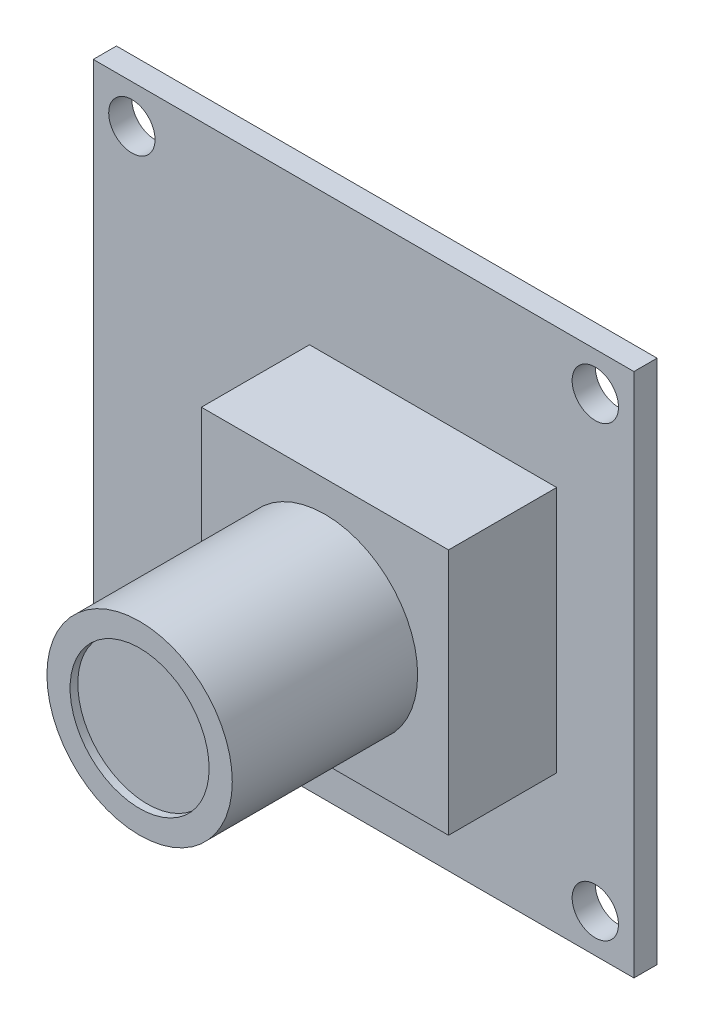
ISO-10303-21;
HEADER;
FILE_DESCRIPTION(('STEP AP214'),'2;1');
FILE_NAME('part.step','',(''),(''),'','','');
FILE_SCHEMA(('AUTOMOTIVE_DESIGN { 1 0 10303 214 1 1 1 1 }'));
ENDSEC;
DATA;
#1=APPLICATION_CONTEXT('core data for automotive mechanical design processes');
#2=APPLICATION_PROTOCOL_DEFINITION('international standard','automotive_design',2000,#1);
#3=PRODUCT_CONTEXT('',#1,'mechanical');
#4=PRODUCT('Part','Part','',(#3));
#5=PRODUCT_RELATED_PRODUCT_CATEGORY('part','',(#4));
#6=PRODUCT_DEFINITION_FORMATION('','',#4);
#7=PRODUCT_DEFINITION_CONTEXT('part definition',#1,'design');
#8=PRODUCT_DEFINITION('design','',#6,#7);
#9=PRODUCT_DEFINITION_SHAPE('','',#8);
#10=(LENGTH_UNIT() NAMED_UNIT(*) SI_UNIT(.MILLI.,.METRE.));
#11=(NAMED_UNIT(*) PLANE_ANGLE_UNIT() SI_UNIT($,.RADIAN.));
#12=(NAMED_UNIT(*) SI_UNIT($,.STERADIAN.) SOLID_ANGLE_UNIT());
#13=UNCERTAINTY_MEASURE_WITH_UNIT(LENGTH_MEASURE(1.E-05),#10,'distance_accuracy_value','');
#14=(GEOMETRIC_REPRESENTATION_CONTEXT(3) GLOBAL_UNCERTAINTY_ASSIGNED_CONTEXT((#13)) GLOBAL_UNIT_ASSIGNED_CONTEXT((#10,
#11,#12)) REPRESENTATION_CONTEXT('',''));
#15=CARTESIAN_POINT('',(0.,0.,0.));
#16=DIRECTION('',(0.,0.,1.));
#17=DIRECTION('',(1.,0.,0.));
#18=AXIS2_PLACEMENT_3D('',#15,#16,#17);
#19=CARTESIAN_POINT('',(0.,0.,-1.5));
#20=DIRECTION('',(0.,0.,-1.));
#21=DIRECTION('',(-1.,0.,0.));
#22=AXIS2_PLACEMENT_3D('',#19,#20,#21);
#23=PLANE('',#22);
#24=CARTESIAN_POINT('',(-15.,14.5,-1.5));
#25=DIRECTION('',(0.,0.,-1.));
#26=DIRECTION('',(-1.,0.,0.));
#27=AXIS2_PLACEMENT_3D('',#24,#25,#26);
#28=CIRCLE('',#27,1.5);
#29=CARTESIAN_POINT('',(-16.5,14.5,-1.5));
#30=VERTEX_POINT('',#29);
#31=EDGE_CURVE('E196',#30,#30,#28,.F.);
#32=ORIENTED_EDGE('',*,*,#31,.T.);
#33=EDGE_LOOP('',(#32));
#34=FACE_BOUND('',#33,.T.);
#35=CARTESIAN_POINT('',(15.,14.5,-1.5));
#36=DIRECTION('',(0.,0.,-1.));
#37=DIRECTION('',(-1.,0.,0.));
#38=AXIS2_PLACEMENT_3D('',#35,#36,#37);
#39=CIRCLE('',#38,1.5);
#40=CARTESIAN_POINT('',(13.5,14.5,-1.5));
#41=VERTEX_POINT('',#40);
#42=EDGE_CURVE('E207',#41,#41,#39,.F.);
#43=ORIENTED_EDGE('',*,*,#42,.T.);
#44=EDGE_LOOP('',(#43));
#45=FACE_BOUND('',#44,.T.);
#46=CARTESIAN_POINT('',(15.,-14.5,-1.5));
#47=DIRECTION('',(0.,0.,-1.));
#48=DIRECTION('',(-1.,0.,0.));
#49=AXIS2_PLACEMENT_3D('',#46,#47,#48);
#50=CIRCLE('',#49,1.5);
#51=CARTESIAN_POINT('',(13.5,-14.5,-1.5));
#52=VERTEX_POINT('',#51);
#53=EDGE_CURVE('E201',#52,#52,#50,.F.);
#54=ORIENTED_EDGE('',*,*,#53,.T.);
#55=EDGE_LOOP('',(#54));
#56=FACE_BOUND('',#55,.T.);
#57=CARTESIAN_POINT('',(-15.,-14.5,-1.5));
#58=DIRECTION('',(0.,0.,-1.));
#59=DIRECTION('',(-1.,0.,0.));
#60=AXIS2_PLACEMENT_3D('',#57,#58,#59);
#61=CIRCLE('',#60,1.5);
#62=CARTESIAN_POINT('',(-16.5,-14.5,-1.5));
#63=VERTEX_POINT('',#62);
#64=EDGE_CURVE('E200',#63,#63,#61,.F.);
#65=ORIENTED_EDGE('',*,*,#64,.T.);
#66=EDGE_LOOP('',(#65));
#67=FACE_BOUND('',#66,.T.);
#68=DIRECTION('',(1.,0.,0.));
#69=VECTOR('',#68,1.);
#70=CARTESIAN_POINT('',(-17.5,17.,-1.5));
#71=LINE('',#70,#69);
#72=CARTESIAN_POINT('',(-17.5,17.,-1.5));
#73=VERTEX_POINT('',#72);
#74=CARTESIAN_POINT('',(17.5,17.,-1.5));
#75=VERTEX_POINT('',#74);
#76=EDGE_CURVE('E221',#73,#75,#71,.T.);
#77=ORIENTED_EDGE('',*,*,#76,.T.);
#78=DIRECTION('',(0.,-1.,0.));
#79=VECTOR('',#78,1.);
#80=CARTESIAN_POINT('',(17.5,17.,-1.5));
#81=LINE('',#80,#79);
#82=CARTESIAN_POINT('',(17.5,-17.,-1.5));
#83=VERTEX_POINT('',#82);
#84=EDGE_CURVE('E224',#75,#83,#81,.T.);
#85=ORIENTED_EDGE('',*,*,#84,.T.);
#86=DIRECTION('',(1.,0.,0.));
#87=VECTOR('',#86,1.);
#88=CARTESIAN_POINT('',(-17.5,-17.,-1.5));
#89=LINE('',#88,#87);
#90=CARTESIAN_POINT('',(-17.5,-17.,-1.5));
#91=VERTEX_POINT('',#90);
#92=EDGE_CURVE('E227',#91,#83,#89,.T.);
#93=ORIENTED_EDGE('',*,*,#92,.F.);
#94=DIRECTION('',(0.,-1.,0.));
#95=VECTOR('',#94,1.);
#96=CARTESIAN_POINT('',(-17.5,17.,-1.5));
#97=LINE('',#96,#95);
#98=EDGE_CURVE('E230',#73,#91,#97,.T.);
#99=ORIENTED_EDGE('',*,*,#98,.F.);
#100=EDGE_LOOP('',(#77,#85,#93,#99));
#101=FACE_BOUND('',#100,.T.);
#102=DIRECTION('',(1.,0.,0.));
#103=VECTOR('',#102,1.);
#104=CARTESIAN_POINT('',(-8.,10.,-1.5));
#105=LINE('',#104,#103);
#106=CARTESIAN_POINT('',(-12.,10.,-1.5));
#107=VERTEX_POINT('',#106);
#108=CARTESIAN_POINT('',(-8.,10.,-1.5));
#109=VERTEX_POINT('',#108);
#110=EDGE_CURVE('E496',#107,#109,#105,.T.);
#111=ORIENTED_EDGE('',*,*,#110,.F.);
#112=DIRECTION('',(0.,1.,0.));
#113=VECTOR('',#112,1.);
#114=CARTESIAN_POINT('',(-12.,10.,-1.5));
#115=LINE('',#114,#113);
#116=CARTESIAN_POINT('',(-12.,-10.,-1.5));
#117=VERTEX_POINT('',#116);
#118=EDGE_CURVE('E151',#117,#107,#115,.T.);
#119=ORIENTED_EDGE('',*,*,#118,.F.);
#120=DIRECTION('',(-1.,0.,0.));
#121=VECTOR('',#120,1.);
#122=CARTESIAN_POINT('',(-8.,-10.,-1.5));
#123=LINE('',#122,#121);
#124=CARTESIAN_POINT('',(-8.,-10.,-1.5));
#125=VERTEX_POINT('',#124);
#126=EDGE_CURVE('E147',#125,#117,#123,.T.);
#127=ORIENTED_EDGE('',*,*,#126,.F.);
#128=DIRECTION('',(0.,-1.,0.));
#129=VECTOR('',#128,1.);
#130=CARTESIAN_POINT('',(-8.,10.,-1.5));
#131=LINE('',#130,#129);
#132=EDGE_CURVE('E493',#109,#125,#131,.T.);
#133=ORIENTED_EDGE('',*,*,#132,.F.);
#134=EDGE_LOOP('',(#111,#119,#127,#133));
#135=FACE_BOUND('',#134,.T.);
#136=ADVANCED_FACE('F38',(#34,#45,#56,#67,#101,#135),#23,.T.);
#137=CARTESIAN_POINT('',(0.,0.,0.));
#138=DIRECTION('',(0.,0.,-1.));
#139=DIRECTION('',(-1.,0.,0.));
#140=AXIS2_PLACEMENT_3D('',#137,#138,#139);
#141=PLANE('',#140);
#142=DIRECTION('',(1.,0.,0.));
#143=VECTOR('',#142,1.);
#144=CARTESIAN_POINT('',(-17.5,17.,0.));
#145=LINE('',#144,#143);
#146=CARTESIAN_POINT('',(-17.5,17.,0.));
#147=VERTEX_POINT('',#146);
#148=CARTESIAN_POINT('',(17.5,17.,0.));
#149=VERTEX_POINT('',#148);
#150=EDGE_CURVE('E218',#147,#149,#145,.T.);
#151=ORIENTED_EDGE('',*,*,#150,.F.);
#152=DIRECTION('',(0.,-1.,0.));
#153=VECTOR('',#152,1.);
#154=CARTESIAN_POINT('',(-17.5,17.,0.));
#155=LINE('',#154,#153);
#156=CARTESIAN_POINT('',(-17.5,-17.,0.));
#157=VERTEX_POINT('',#156);
#158=EDGE_CURVE('E225',#147,#157,#155,.T.);
#159=ORIENTED_EDGE('',*,*,#158,.T.);
#160=DIRECTION('',(1.,0.,0.));
#161=VECTOR('',#160,1.);
#162=CARTESIAN_POINT('',(-17.5,-17.,0.));
#163=LINE('',#162,#161);
#164=CARTESIAN_POINT('',(17.5,-17.,0.));
#165=VERTEX_POINT('',#164);
#166=EDGE_CURVE('E239',#157,#165,#163,.T.);
#167=ORIENTED_EDGE('',*,*,#166,.T.);
#168=DIRECTION('',(0.,-1.,0.));
#169=VECTOR('',#168,1.);
#170=CARTESIAN_POINT('',(17.5,17.,0.));
#171=LINE('',#170,#169);
#172=EDGE_CURVE('E236',#149,#165,#171,.T.);
#173=ORIENTED_EDGE('',*,*,#172,.F.);
#174=EDGE_LOOP('',(#151,#159,#167,#173));
#175=FACE_BOUND('',#174,.T.);
#176=CARTESIAN_POINT('',(-15.,-14.5,0.));
#177=DIRECTION('',(0.,0.,1.));
#178=DIRECTION('',(1.,0.,0.));
#179=AXIS2_PLACEMENT_3D('',#176,#177,#178);
#180=CIRCLE('',#179,1.5);
#181=CARTESIAN_POINT('',(-13.5,-14.5,0.));
#182=VERTEX_POINT('',#181);
#183=EDGE_CURVE('E215',#182,#182,#180,.T.);
#184=ORIENTED_EDGE('',*,*,#183,.F.);
#185=EDGE_LOOP('',(#184));
#186=FACE_BOUND('',#185,.T.);
#187=CARTESIAN_POINT('',(15.,-14.5,0.));
#188=DIRECTION('',(0.,0.,1.));
#189=DIRECTION('',(-1.,0.,0.));
#190=AXIS2_PLACEMENT_3D('',#187,#188,#189);
#191=CIRCLE('',#190,1.5);
#192=CARTESIAN_POINT('',(13.5,-14.5,0.));
#193=VERTEX_POINT('',#192);
#194=EDGE_CURVE('E197',#193,#193,#191,.T.);
#195=ORIENTED_EDGE('',*,*,#194,.F.);
#196=EDGE_LOOP('',(#195));
#197=FACE_BOUND('',#196,.T.);
#198=CARTESIAN_POINT('',(15.,14.5,0.));
#199=DIRECTION('',(0.,0.,1.));
#200=DIRECTION('',(1.,0.,0.));
#201=AXIS2_PLACEMENT_3D('',#198,#199,#200);
#202=CIRCLE('',#201,1.5);
#203=CARTESIAN_POINT('',(16.5,14.5,0.));
#204=VERTEX_POINT('',#203);
#205=EDGE_CURVE('E204',#204,#204,#202,.T.);
#206=ORIENTED_EDGE('',*,*,#205,.F.);
#207=EDGE_LOOP('',(#206));
#208=FACE_BOUND('',#207,.T.);
#209=CARTESIAN_POINT('',(-15.,14.5,0.));
#210=DIRECTION('',(0.,0.,1.));
#211=DIRECTION('',(-1.,0.,0.));
#212=AXIS2_PLACEMENT_3D('',#209,#210,#211);
#213=CIRCLE('',#212,1.5);
#214=CARTESIAN_POINT('',(-16.5,14.5,0.));
#215=VERTEX_POINT('',#214);
#216=EDGE_CURVE('E210',#215,#215,#213,.T.);
#217=ORIENTED_EDGE('',*,*,#216,.F.);
#218=EDGE_LOOP('',(#217));
#219=FACE_BOUND('',#218,.T.);
#220=DIRECTION('',(0.,-1.,0.));
#221=VECTOR('',#220,1.);
#222=CARTESIAN_POINT('',(-3.5,-8.,0.));
#223=LINE('',#222,#221);
#224=CARTESIAN_POINT('',(-3.5,8.,0.));
#225=VERTEX_POINT('',#224);
#226=CARTESIAN_POINT('',(-3.5,-8.,0.));
#227=VERTEX_POINT('',#226);
#228=EDGE_CURVE('E165',#225,#227,#223,.T.);
#229=ORIENTED_EDGE('',*,*,#228,.F.);
#230=DIRECTION('',(-1.,0.,0.));
#231=VECTOR('',#230,1.);
#232=CARTESIAN_POINT('',(-3.5,8.,0.));
#233=LINE('',#232,#231);
#234=CARTESIAN_POINT('',(12.5,8.,0.));
#235=VERTEX_POINT('',#234);
#236=EDGE_CURVE('E171',#235,#225,#233,.T.);
#237=ORIENTED_EDGE('',*,*,#236,.F.);
#238=DIRECTION('',(0.,1.,0.));
#239=VECTOR('',#238,1.);
#240=CARTESIAN_POINT('',(12.5,8.,0.));
#241=LINE('',#240,#239);
#242=CARTESIAN_POINT('',(12.5,-8.,0.));
#243=VERTEX_POINT('',#242);
#244=EDGE_CURVE('E181',#243,#235,#241,.T.);
#245=ORIENTED_EDGE('',*,*,#244,.F.);
#246=DIRECTION('',(1.,0.,0.));
#247=VECTOR('',#246,1.);
#248=CARTESIAN_POINT('',(12.5,-8.,0.));
#249=LINE('',#248,#247);
#250=EDGE_CURVE('E62',#227,#243,#249,.T.);
#251=ORIENTED_EDGE('',*,*,#250,.F.);
#252=EDGE_LOOP('',(#229,#237,#245,#251));
#253=FACE_BOUND('',#252,.T.);
#254=ADVANCED_FACE('F259',(#175,#186,#197,#208,#219,#253),#141,.F.);
#255=CARTESIAN_POINT('',(-17.5,17.,-1.5));
#256=DIRECTION('',(0.,-1.,0.));
#257=DIRECTION('',(0.,0.,-1.));
#258=AXIS2_PLACEMENT_3D('',#255,#256,#257);
#259=PLANE('',#258);
#260=ORIENTED_EDGE('',*,*,#150,.T.);
#261=DIRECTION('',(0.,0.,1.));
#262=VECTOR('',#261,1.);
#263=CARTESIAN_POINT('',(17.5,17.,-1.5));
#264=LINE('',#263,#262);
#265=EDGE_CURVE('E42',#75,#149,#264,.T.);
#266=ORIENTED_EDGE('',*,*,#265,.F.);
#267=ORIENTED_EDGE('',*,*,#76,.F.);
#268=DIRECTION('',(0.,0.,1.));
#269=VECTOR('',#268,1.);
#270=CARTESIAN_POINT('',(-17.5,17.,-1.5));
#271=LINE('',#270,#269);
#272=EDGE_CURVE('E233',#73,#147,#271,.T.);
#273=ORIENTED_EDGE('',*,*,#272,.T.);
#274=EDGE_LOOP('',(#260,#266,#267,#273));
#275=FACE_BOUND('',#274,.T.);
#276=ADVANCED_FACE('F40',(#275),#259,.F.);
#277=CARTESIAN_POINT('',(17.5,17.,-1.5));
#278=DIRECTION('',(-1.,0.,0.));
#279=DIRECTION('',(0.,-1.,0.));
#280=AXIS2_PLACEMENT_3D('',#277,#278,#279);
#281=PLANE('',#280);
#282=ORIENTED_EDGE('',*,*,#172,.T.);
#283=DIRECTION('',(0.,0.,1.));
#284=VECTOR('',#283,1.);
#285=CARTESIAN_POINT('',(17.5,-17.,-1.5));
#286=LINE('',#285,#284);
#287=EDGE_CURVE('E246',#83,#165,#286,.T.);
#288=ORIENTED_EDGE('',*,*,#287,.F.);
#289=ORIENTED_EDGE('',*,*,#84,.F.);
#290=ORIENTED_EDGE('',*,*,#265,.T.);
#291=EDGE_LOOP('',(#282,#288,#289,#290));
#292=FACE_BOUND('',#291,.T.);
#293=ADVANCED_FACE('F253',(#292),#281,.F.);
#294=CARTESIAN_POINT('',(-17.5,-17.,-1.5));
#295=DIRECTION('',(0.,-1.,0.));
#296=DIRECTION('',(0.,0.,-1.));
#297=AXIS2_PLACEMENT_3D('',#294,#295,#296);
#298=PLANE('',#297);
#299=ORIENTED_EDGE('',*,*,#166,.F.);
#300=DIRECTION('',(0.,0.,1.));
#301=VECTOR('',#300,1.);
#302=CARTESIAN_POINT('',(-17.5,-17.,-1.5));
#303=LINE('',#302,#301);
#304=EDGE_CURVE('E245',#91,#157,#303,.T.);
#305=ORIENTED_EDGE('',*,*,#304,.F.);
#306=ORIENTED_EDGE('',*,*,#92,.T.);
#307=ORIENTED_EDGE('',*,*,#287,.T.);
#308=EDGE_LOOP('',(#299,#305,#306,#307));
#309=FACE_BOUND('',#308,.T.);
#310=ADVANCED_FACE('F265',(#309),#298,.T.);
#311=CARTESIAN_POINT('',(-17.5,17.,-1.5));
#312=DIRECTION('',(-1.,0.,0.));
#313=DIRECTION('',(0.,-1.,0.));
#314=AXIS2_PLACEMENT_3D('',#311,#312,#313);
#315=PLANE('',#314);
#316=ORIENTED_EDGE('',*,*,#158,.F.);
#317=ORIENTED_EDGE('',*,*,#272,.F.);
#318=ORIENTED_EDGE('',*,*,#98,.T.);
#319=ORIENTED_EDGE('',*,*,#304,.T.);
#320=EDGE_LOOP('',(#316,#317,#318,#319));
#321=FACE_BOUND('',#320,.T.);
#322=ADVANCED_FACE('F262',(#321),#315,.T.);
#323=CARTESIAN_POINT('',(-15.,-14.5,-1.501));
#324=DIRECTION('',(0.,0.,1.));
#325=DIRECTION('',(1.,0.,0.));
#326=AXIS2_PLACEMENT_3D('',#323,#324,#325);
#327=CYLINDRICAL_SURFACE('',#326,1.5);
#328=ORIENTED_EDGE('',*,*,#64,.F.);
#329=EDGE_LOOP('',(#328));
#330=FACE_BOUND('',#329,.T.);
#331=ORIENTED_EDGE('',*,*,#183,.T.);
#332=EDGE_LOOP('',(#331));
#333=FACE_BOUND('',#332,.T.);
#334=ADVANCED_FACE('F272',(#330,#333),#327,.F.);
#335=CARTESIAN_POINT('',(15.,-14.5,-1.501));
#336=DIRECTION('',(0.,0.,1.));
#337=DIRECTION('',(1.,0.,0.));
#338=AXIS2_PLACEMENT_3D('',#335,#336,#337);
#339=CYLINDRICAL_SURFACE('',#338,1.5);
#340=ORIENTED_EDGE('',*,*,#53,.F.);
#341=EDGE_LOOP('',(#340));
#342=FACE_BOUND('',#341,.T.);
#343=ORIENTED_EDGE('',*,*,#194,.T.);
#344=EDGE_LOOP('',(#343));
#345=FACE_BOUND('',#344,.T.);
#346=ADVANCED_FACE('F285',(#342,#345),#339,.F.);
#347=CARTESIAN_POINT('',(15.,14.5,-1.501));
#348=DIRECTION('',(0.,0.,1.));
#349=DIRECTION('',(1.,0.,0.));
#350=AXIS2_PLACEMENT_3D('',#347,#348,#349);
#351=CYLINDRICAL_SURFACE('',#350,1.5);
#352=ORIENTED_EDGE('',*,*,#42,.F.);
#353=EDGE_LOOP('',(#352));
#354=FACE_BOUND('',#353,.T.);
#355=ORIENTED_EDGE('',*,*,#205,.T.);
#356=EDGE_LOOP('',(#355));
#357=FACE_BOUND('',#356,.T.);
#358=ADVANCED_FACE('F291',(#354,#357),#351,.F.);
#359=CARTESIAN_POINT('',(-15.,14.5,-1.501));
#360=DIRECTION('',(0.,0.,1.));
#361=DIRECTION('',(1.,0.,0.));
#362=AXIS2_PLACEMENT_3D('',#359,#360,#361);
#363=CYLINDRICAL_SURFACE('',#362,1.5);
#364=ORIENTED_EDGE('',*,*,#31,.F.);
#365=EDGE_LOOP('',(#364));
#366=FACE_BOUND('',#365,.T.);
#367=ORIENTED_EDGE('',*,*,#216,.T.);
#368=EDGE_LOOP('',(#367));
#369=FACE_BOUND('',#368,.T.);
#370=ADVANCED_FACE('F287',(#366,#369),#363,.F.);
#371=CARTESIAN_POINT('',(-3.5,-8.,7.));
#372=DIRECTION('',(1.,0.,0.));
#373=DIRECTION('',(0.,1.,0.));
#374=AXIS2_PLACEMENT_3D('',#371,#372,#373);
#375=PLANE('',#374);
#376=ORIENTED_EDGE('',*,*,#228,.T.);
#377=DIRECTION('',(0.,0.,-1.));
#378=VECTOR('',#377,1.);
#379=CARTESIAN_POINT('',(-3.5,-8.,7.));
#380=LINE('',#379,#378);
#381=CARTESIAN_POINT('',(-3.5,-8.,7.));
#382=VERTEX_POINT('',#381);
#383=EDGE_CURVE('E194',#382,#227,#380,.T.);
#384=ORIENTED_EDGE('',*,*,#383,.F.);
#385=DIRECTION('',(0.,-1.,0.));
#386=VECTOR('',#385,1.);
#387=CARTESIAN_POINT('',(-3.5,-8.,7.));
#388=LINE('',#387,#386);
#389=CARTESIAN_POINT('',(-3.5,8.,7.));
#390=VERTEX_POINT('',#389);
#391=EDGE_CURVE('E167',#390,#382,#388,.T.);
#392=ORIENTED_EDGE('',*,*,#391,.F.);
#393=DIRECTION('',(0.,0.,-1.));
#394=VECTOR('',#393,1.);
#395=CARTESIAN_POINT('',(-3.5,8.,7.));
#396=LINE('',#395,#394);
#397=EDGE_CURVE('E177',#390,#225,#396,.T.);
#398=ORIENTED_EDGE('',*,*,#397,.T.);
#399=EDGE_LOOP('',(#376,#384,#392,#398));
#400=FACE_BOUND('',#399,.T.);
#401=ADVANCED_FACE('F290',(#400),#375,.F.);
#402=CARTESIAN_POINT('',(12.5,-8.,7.));
#403=DIRECTION('',(0.,1.,0.));
#404=DIRECTION('',(-1.,0.,0.));
#405=AXIS2_PLACEMENT_3D('',#402,#403,#404);
#406=PLANE('',#405);
#407=ORIENTED_EDGE('',*,*,#250,.T.);
#408=DIRECTION('',(0.,0.,-1.));
#409=VECTOR('',#408,1.);
#410=CARTESIAN_POINT('',(12.5,-8.,7.));
#411=LINE('',#410,#409);
#412=CARTESIAN_POINT('',(12.5,-8.,7.));
#413=VERTEX_POINT('',#412);
#414=EDGE_CURVE('E191',#413,#243,#411,.T.);
#415=ORIENTED_EDGE('',*,*,#414,.F.);
#416=DIRECTION('',(1.,0.,0.));
#417=VECTOR('',#416,1.);
#418=CARTESIAN_POINT('',(12.5,-8.,7.));
#419=LINE('',#418,#417);
#420=EDGE_CURVE('E170',#382,#413,#419,.T.);
#421=ORIENTED_EDGE('',*,*,#420,.F.);
#422=ORIENTED_EDGE('',*,*,#383,.T.);
#423=EDGE_LOOP('',(#407,#415,#421,#422));
#424=FACE_BOUND('',#423,.T.);
#425=ADVANCED_FACE('F301',(#424),#406,.F.);
#426=CARTESIAN_POINT('',(12.5,8.,7.));
#427=DIRECTION('',(-1.,0.,0.));
#428=DIRECTION('',(0.,0.,1.));
#429=AXIS2_PLACEMENT_3D('',#426,#427,#428);
#430=PLANE('',#429);
#431=ORIENTED_EDGE('',*,*,#244,.T.);
#432=DIRECTION('',(0.,0.,-1.));
#433=VECTOR('',#432,1.);
#434=CARTESIAN_POINT('',(12.5,8.,7.));
#435=LINE('',#434,#433);
#436=CARTESIAN_POINT('',(12.5,8.,7.));
#437=VERTEX_POINT('',#436);
#438=EDGE_CURVE('E188',#437,#235,#435,.T.);
#439=ORIENTED_EDGE('',*,*,#438,.F.);
#440=DIRECTION('',(0.,1.,0.));
#441=VECTOR('',#440,1.);
#442=CARTESIAN_POINT('',(12.5,8.,7.));
#443=LINE('',#442,#441);
#444=EDGE_CURVE('E173',#413,#437,#443,.T.);
#445=ORIENTED_EDGE('',*,*,#444,.F.);
#446=ORIENTED_EDGE('',*,*,#414,.T.);
#447=EDGE_LOOP('',(#431,#439,#445,#446));
#448=FACE_BOUND('',#447,.T.);
#449=ADVANCED_FACE('F305',(#448),#430,.F.);
#450=CARTESIAN_POINT('',(-3.5,8.,7.));
#451=DIRECTION('',(0.,-1.,0.));
#452=DIRECTION('',(0.,0.,-1.));
#453=AXIS2_PLACEMENT_3D('',#450,#451,#452);
#454=PLANE('',#453);
#455=ORIENTED_EDGE('',*,*,#236,.T.);
#456=ORIENTED_EDGE('',*,*,#397,.F.);
#457=DIRECTION('',(-1.,0.,0.));
#458=VECTOR('',#457,1.);
#459=CARTESIAN_POINT('',(-3.5,8.,7.));
#460=LINE('',#459,#458);
#461=EDGE_CURVE('E175',#437,#390,#460,.T.);
#462=ORIENTED_EDGE('',*,*,#461,.F.);
#463=ORIENTED_EDGE('',*,*,#438,.T.);
#464=EDGE_LOOP('',(#455,#456,#462,#463));
#465=FACE_BOUND('',#464,.T.);
#466=ADVANCED_FACE('F309',(#465),#454,.F.);
#467=CARTESIAN_POINT('',(0.,0.,7.));
#468=DIRECTION('',(0.,0.,-1.));
#469=DIRECTION('',(-1.,0.,0.));
#470=AXIS2_PLACEMENT_3D('',#467,#468,#469);
#471=PLANE('',#470);
#472=CARTESIAN_POINT('',(4.5,0.,7.));
#473=DIRECTION('',(0.,0.,1.));
#474=DIRECTION('',(1.,0.,0.));
#475=AXIS2_PLACEMENT_3D('',#472,#473,#474);
#476=CIRCLE('',#475,6.);
#477=CARTESIAN_POINT('',(10.5,0.,7.));
#478=VERTEX_POINT('',#477);
#479=EDGE_CURVE('E11',#478,#478,#476,.T.);
#480=ORIENTED_EDGE('',*,*,#479,.F.);
#481=EDGE_LOOP('',(#480));
#482=FACE_BOUND('',#481,.T.);
#483=ORIENTED_EDGE('',*,*,#391,.T.);
#484=ORIENTED_EDGE('',*,*,#420,.T.);
#485=ORIENTED_EDGE('',*,*,#444,.T.);
#486=ORIENTED_EDGE('',*,*,#461,.T.);
#487=EDGE_LOOP('',(#483,#484,#485,#486));
#488=FACE_BOUND('',#487,.T.);
#489=ADVANCED_FACE('F313',(#482,#488),#471,.F.);
#490=CARTESIAN_POINT('',(4.5,0.,19.));
#491=DIRECTION('',(0.,0.,-1.));
#492=DIRECTION('',(-1.,0.,0.));
#493=AXIS2_PLACEMENT_3D('',#490,#491,#492);
#494=CYLINDRICAL_SURFACE('',#493,6.);
#495=CARTESIAN_POINT('',(4.5,0.,19.));
#496=DIRECTION('',(0.,0.,1.));
#497=DIRECTION('',(1.,0.,0.));
#498=AXIS2_PLACEMENT_3D('',#495,#496,#497);
#499=CIRCLE('',#498,6.);
#500=CARTESIAN_POINT('',(10.5,0.,19.));
#501=VERTEX_POINT('',#500);
#502=EDGE_CURVE('E162',#501,#501,#499,.T.);
#503=ORIENTED_EDGE('',*,*,#502,.F.);
#504=EDGE_LOOP('',(#503));
#505=FACE_BOUND('',#504,.T.);
#506=ORIENTED_EDGE('',*,*,#479,.T.);
#507=EDGE_LOOP('',(#506));
#508=FACE_BOUND('',#507,.T.);
#509=ADVANCED_FACE('F317',(#505,#508),#494,.T.);
#510=CARTESIAN_POINT('',(4.5,0.,19.));
#511=DIRECTION('',(0.,0.,1.));
#512=DIRECTION('',(1.,0.,0.));
#513=AXIS2_PLACEMENT_3D('',#510,#511,#512);
#514=PLANE('',#513);
#515=CARTESIAN_POINT('',(4.5,0.,19.));
#516=DIRECTION('',(0.,0.,1.));
#517=DIRECTION('',(1.,0.,0.));
#518=AXIS2_PLACEMENT_3D('',#515,#516,#517);
#519=CIRCLE('',#518,4.5);
#520=CARTESIAN_POINT('',(9.,0.,19.));
#521=VERTEX_POINT('',#520);
#522=EDGE_CURVE('E153',#521,#521,#519,.T.);
#523=ORIENTED_EDGE('',*,*,#522,.F.);
#524=EDGE_LOOP('',(#523));
#525=FACE_BOUND('',#524,.T.);
#526=ORIENTED_EDGE('',*,*,#502,.T.);
#527=EDGE_LOOP('',(#526));
#528=FACE_BOUND('',#527,.T.);
#529=ADVANCED_FACE('F321',(#525,#528),#514,.T.);
#530=CARTESIAN_POINT('',(4.5,0.,18.5));
#531=DIRECTION('',(0.,0.,1.));
#532=DIRECTION('',(1.,0.,0.));
#533=AXIS2_PLACEMENT_3D('',#530,#531,#532);
#534=CYLINDRICAL_SURFACE('',#533,4.5);
#535=CARTESIAN_POINT('',(4.5,0.,18.5));
#536=DIRECTION('',(0.,0.,1.));
#537=DIRECTION('',(1.,0.,0.));
#538=AXIS2_PLACEMENT_3D('',#535,#536,#537);
#539=CIRCLE('',#538,4.5);
#540=CARTESIAN_POINT('',(9.,0.,18.5));
#541=VERTEX_POINT('',#540);
#542=EDGE_CURVE('E156',#541,#541,#539,.T.);
#543=ORIENTED_EDGE('',*,*,#542,.F.);
#544=EDGE_LOOP('',(#543));
#545=FACE_BOUND('',#544,.T.);
#546=ORIENTED_EDGE('',*,*,#522,.T.);
#547=EDGE_LOOP('',(#546));
#548=FACE_BOUND('',#547,.T.);
#549=ADVANCED_FACE('F325',(#545,#548),#534,.F.);
#550=CARTESIAN_POINT('',(4.5,0.,18.5));
#551=DIRECTION('',(0.,0.,1.));
#552=DIRECTION('',(1.,0.,0.));
#553=AXIS2_PLACEMENT_3D('',#550,#551,#552);
#554=PLANE('',#553);
#555=ORIENTED_EDGE('',*,*,#542,.T.);
#556=EDGE_LOOP('',(#555));
#557=FACE_BOUND('',#556,.T.);
#558=ADVANCED_FACE('F329',(#557),#554,.T.);
#559=CARTESIAN_POINT('',(-12.,10.,-7.5));
#560=DIRECTION('',(1.,0.,0.));
#561=DIRECTION('',(0.,1.,0.));
#562=AXIS2_PLACEMENT_3D('',#559,#560,#561);
#563=PLANE('',#562);
#564=ORIENTED_EDGE('',*,*,#118,.T.);
#565=DIRECTION('',(0.,0.,1.));
#566=VECTOR('',#565,1.);
#567=CARTESIAN_POINT('',(-12.,10.,-7.5));
#568=LINE('',#567,#566);
#569=CARTESIAN_POINT('',(-12.,10.,-7.5));
#570=VERTEX_POINT('',#569);
#571=EDGE_CURVE('E132',#570,#107,#568,.T.);
#572=ORIENTED_EDGE('',*,*,#571,.F.);
#573=DIRECTION('',(0.,1.,0.));
#574=VECTOR('',#573,1.);
#575=CARTESIAN_POINT('',(-12.,10.,-7.5));
#576=LINE('',#575,#574);
#577=CARTESIAN_POINT('',(-12.,-10.,-7.5));
#578=VERTEX_POINT('',#577);
#579=EDGE_CURVE('E139',#578,#570,#576,.T.);
#580=ORIENTED_EDGE('',*,*,#579,.F.);
#581=DIRECTION('',(0.,0.,1.));
#582=VECTOR('',#581,1.);
#583=CARTESIAN_POINT('',(-12.,-10.,-7.5));
#584=LINE('',#583,#582);
#585=EDGE_CURVE('E490',#578,#117,#584,.T.);
#586=ORIENTED_EDGE('',*,*,#585,.T.);
#587=EDGE_LOOP('',(#564,#572,#580,#586));
#588=FACE_BOUND('',#587,.T.);
#589=ADVANCED_FACE('F149',(#588),#563,.F.);
#590=CARTESIAN_POINT('',(-8.,10.,-7.5));
#591=DIRECTION('',(0.,-1.,0.));
#592=DIRECTION('',(0.,0.,-1.));
#593=AXIS2_PLACEMENT_3D('',#590,#591,#592);
#594=PLANE('',#593);
#595=ORIENTED_EDGE('',*,*,#110,.T.);
#596=DIRECTION('',(0.,0.,1.));
#597=VECTOR('',#596,1.);
#598=CARTESIAN_POINT('',(-8.,10.,-7.5));
#599=LINE('',#598,#597);
#600=CARTESIAN_POINT('',(-8.,10.,-7.5));
#601=VERTEX_POINT('',#600);
#602=EDGE_CURVE('E135',#601,#109,#599,.T.);
#603=ORIENTED_EDGE('',*,*,#602,.F.);
#604=DIRECTION('',(1.,0.,0.));
#605=VECTOR('',#604,1.);
#606=CARTESIAN_POINT('',(-8.,10.,-7.5));
#607=LINE('',#606,#605);
#608=EDGE_CURVE('E128',#570,#601,#607,.T.);
#609=ORIENTED_EDGE('',*,*,#608,.F.);
#610=ORIENTED_EDGE('',*,*,#571,.T.);
#611=EDGE_LOOP('',(#595,#603,#609,#610));
#612=FACE_BOUND('',#611,.T.);
#613=ADVANCED_FACE('F130',(#612),#594,.F.);
#614=CARTESIAN_POINT('',(-8.,10.,-7.5));
#615=DIRECTION('',(-1.,0.,0.));
#616=DIRECTION('',(0.,-1.,0.));
#617=AXIS2_PLACEMENT_3D('',#614,#615,#616);
#618=PLANE('',#617);
#619=ORIENTED_EDGE('',*,*,#132,.T.);
#620=DIRECTION('',(0.,0.,1.));
#621=VECTOR('',#620,1.);
#622=CARTESIAN_POINT('',(-8.,-10.,-7.5));
#623=LINE('',#622,#621);
#624=CARTESIAN_POINT('',(-8.,-10.,-7.5));
#625=VERTEX_POINT('',#624);
#626=EDGE_CURVE('E54',#625,#125,#623,.T.);
#627=ORIENTED_EDGE('',*,*,#626,.F.);
#628=DIRECTION('',(0.,-1.,0.));
#629=VECTOR('',#628,1.);
#630=CARTESIAN_POINT('',(-8.,10.,-7.5));
#631=LINE('',#630,#629);
#632=EDGE_CURVE('E138',#601,#625,#631,.T.);
#633=ORIENTED_EDGE('',*,*,#632,.F.);
#634=ORIENTED_EDGE('',*,*,#602,.T.);
#635=EDGE_LOOP('',(#619,#627,#633,#634));
#636=FACE_BOUND('',#635,.T.);
#637=ADVANCED_FACE('F338',(#636),#618,.F.);
#638=CARTESIAN_POINT('',(-8.,-10.,-7.5));
#639=DIRECTION('',(0.,1.,0.));
#640=DIRECTION('',(0.,0.,1.));
#641=AXIS2_PLACEMENT_3D('',#638,#639,#640);
#642=PLANE('',#641);
#643=ORIENTED_EDGE('',*,*,#126,.T.);
#644=ORIENTED_EDGE('',*,*,#585,.F.);
#645=DIRECTION('',(-1.,0.,0.));
#646=VECTOR('',#645,1.);
#647=CARTESIAN_POINT('',(-8.,-10.,-7.5));
#648=LINE('',#647,#646);
#649=EDGE_CURVE('E143',#625,#578,#648,.T.);
#650=ORIENTED_EDGE('',*,*,#649,.F.);
#651=ORIENTED_EDGE('',*,*,#626,.T.);
#652=EDGE_LOOP('',(#643,#644,#650,#651));
#653=FACE_BOUND('',#652,.T.);
#654=ADVANCED_FACE('F341',(#653),#642,.F.);
#655=CARTESIAN_POINT('',(0.,0.,-7.5));
#656=DIRECTION('',(0.,0.,-1.));
#657=DIRECTION('',(-1.,0.,0.));
#658=AXIS2_PLACEMENT_3D('',#655,#656,#657);
#659=PLANE('',#658);
#660=ORIENTED_EDGE('',*,*,#579,.T.);
#661=ORIENTED_EDGE('',*,*,#608,.T.);
#662=ORIENTED_EDGE('',*,*,#632,.T.);
#663=ORIENTED_EDGE('',*,*,#649,.T.);
#664=EDGE_LOOP('',(#660,#661,#662,#663));
#665=FACE_BOUND('',#664,.T.);
#666=ADVANCED_FACE('F142',(#665),#659,.T.);
#667=CLOSED_SHELL('',(#136,#254,#276,#293,#310,#322,#334,#346,#358,#370,#401,#425,#449,#466,
#489,#509,#529,#549,#558,#589,#613,#637,#654,#666));
#668=MANIFOLD_SOLID_BREP('B2',#667);
#669=ADVANCED_BREP_SHAPE_REPRESENTATION('',(#18,#668),#14);
#670=SHAPE_DEFINITION_REPRESENTATION(#9,#669);
ENDSEC;
END-ISO-10303-21;
